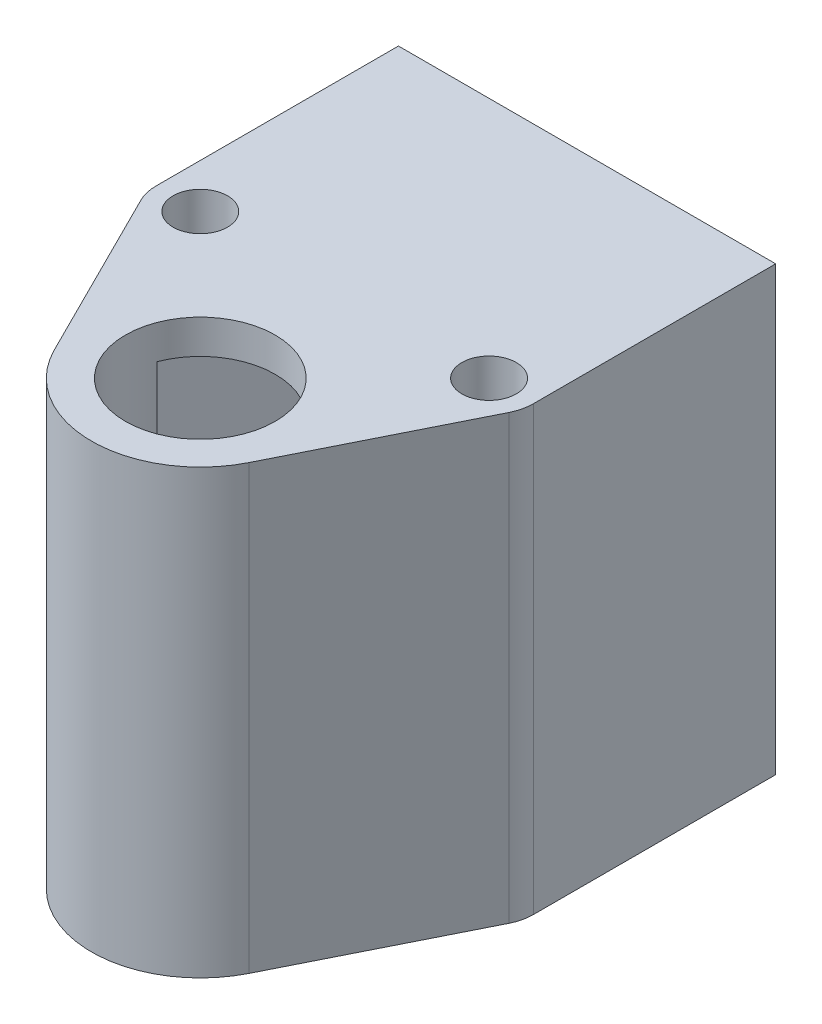
ISO-10303-21;
HEADER;
FILE_DESCRIPTION(('STEP AP214'),'2;1');
FILE_NAME('part.step','',(''),(''),'','','');
FILE_SCHEMA(('AUTOMOTIVE_DESIGN { 1 0 10303 214 1 1 1 1 }'));
ENDSEC;
DATA;
#1=APPLICATION_CONTEXT('core data for automotive mechanical design processes');
#2=APPLICATION_PROTOCOL_DEFINITION('international standard','automotive_design',2000,#1);
#3=PRODUCT_CONTEXT('',#1,'mechanical');
#4=PRODUCT('Part','Part','',(#3));
#5=PRODUCT_RELATED_PRODUCT_CATEGORY('part','',(#4));
#6=PRODUCT_DEFINITION_FORMATION('','',#4);
#7=PRODUCT_DEFINITION_CONTEXT('part definition',#1,'design');
#8=PRODUCT_DEFINITION('design','',#6,#7);
#9=PRODUCT_DEFINITION_SHAPE('','',#8);
#10=(LENGTH_UNIT() NAMED_UNIT(*) SI_UNIT(.MILLI.,.METRE.));
#11=(NAMED_UNIT(*) PLANE_ANGLE_UNIT() SI_UNIT($,.RADIAN.));
#12=(NAMED_UNIT(*) SI_UNIT($,.STERADIAN.) SOLID_ANGLE_UNIT());
#13=UNCERTAINTY_MEASURE_WITH_UNIT(LENGTH_MEASURE(1.E-05),#10,'distance_accuracy_value','');
#14=(GEOMETRIC_REPRESENTATION_CONTEXT(3) GLOBAL_UNCERTAINTY_ASSIGNED_CONTEXT((#13)) GLOBAL_UNIT_ASSIGNED_CONTEXT((#10,
#11,#12)) REPRESENTATION_CONTEXT('',''));
#15=CARTESIAN_POINT('',(0.,0.,0.));
#16=DIRECTION('',(0.,0.,1.));
#17=DIRECTION('',(1.,0.,0.));
#18=AXIS2_PLACEMENT_3D('',#15,#16,#17);
#19=CARTESIAN_POINT('',(0.,55.,0.));
#20=DIRECTION('',(0.,-1.,0.));
#21=DIRECTION('',(0.,0.,-1.));
#22=AXIS2_PLACEMENT_3D('',#19,#20,#21);
#23=CYLINDRICAL_SURFACE('',#22,16.);
#24=DIRECTION('',(0.,-1.,0.));
#25=VECTOR('',#24,1.);
#26=CARTESIAN_POINT('',(-14.3141441755366,55.,7.14879545951293));
#27=LINE('',#26,#25);
#28=CARTESIAN_POINT('',(-14.3141441755366,60.,7.14879545951293));
#29=VERTEX_POINT('',#28);
#30=CARTESIAN_POINT('',(-14.3141441755366,-5.,7.14879545951293));
#31=VERTEX_POINT('',#30);
#32=EDGE_CURVE('E228',#29,#31,#27,.T.);
#33=ORIENTED_EDGE('',*,*,#32,.T.);
#34=CARTESIAN_POINT('',(0.,-5.,0.));
#35=DIRECTION('',(0.,-1.,0.));
#36=DIRECTION('',(0.,0.,-1.));
#37=AXIS2_PLACEMENT_3D('',#34,#35,#36);
#38=CIRCLE('',#37,16.);
#39=CARTESIAN_POINT('',(14.3141441755366,-5.,7.14879545951293));
#40=VERTEX_POINT('',#39);
#41=EDGE_CURVE('E175',#40,#31,#38,.T.);
#42=ORIENTED_EDGE('',*,*,#41,.F.);
#43=DIRECTION('',(0.,-1.,0.));
#44=VECTOR('',#43,1.);
#45=CARTESIAN_POINT('',(14.3141441755366,55.,7.14879545951293));
#46=LINE('',#45,#44);
#47=CARTESIAN_POINT('',(14.3141441755366,60.,7.14879545951293));
#48=VERTEX_POINT('',#47);
#49=EDGE_CURVE('E11',#48,#40,#46,.T.);
#50=ORIENTED_EDGE('',*,*,#49,.F.);
#51=CARTESIAN_POINT('',(0.,60.,0.));
#52=DIRECTION('',(0.,1.,0.));
#53=DIRECTION('',(0.,0.,1.));
#54=AXIS2_PLACEMENT_3D('',#51,#52,#53);
#55=CIRCLE('',#54,16.);
#56=EDGE_CURVE('E195',#29,#48,#55,.T.);
#57=ORIENTED_EDGE('',*,*,#56,.F.);
#58=EDGE_LOOP('',(#33,#42,#50,#57));
#59=FACE_BOUND('',#58,.T.);
#60=ADVANCED_FACE('F33',(#59),#23,.T.);
#61=CARTESIAN_POINT('',(14.3141441755366,55.,7.14879545951293));
#62=DIRECTION('',(-0.894634010971035,0.,-0.446799716219558));
#63=DIRECTION('',(-0.446799716219558,0.,0.894634010971035));
#64=AXIS2_PLACEMENT_3D('',#61,#62,#63);
#65=PLANE('',#64);
#66=ORIENTED_EDGE('',*,*,#49,.T.);
#67=DIRECTION('',(-0.446799716219558,0.,0.894634010971035));
#68=VECTOR('',#67,1.);
#69=CARTESIAN_POINT('',(14.3141441755366,-5.,7.14879545951293));
#70=LINE('',#69,#68);
#71=CARTESIAN_POINT('',(27.0283245069082,-5.,-18.3090052801693));
#72=VERTEX_POINT('',#71);
#73=EDGE_CURVE('E172',#72,#40,#70,.T.);
#74=ORIENTED_EDGE('',*,*,#73,.F.);
#75=DIRECTION('',(0.,-1.,0.));
#76=VECTOR('',#75,1.);
#77=CARTESIAN_POINT('',(27.0283245069082,55.,-18.3090052801693));
#78=LINE('',#77,#76);
#79=CARTESIAN_POINT('',(27.0283245069082,60.,-18.3090052801693));
#80=VERTEX_POINT('',#79);
#81=EDGE_CURVE('E41',#80,#72,#78,.T.);
#82=ORIENTED_EDGE('',*,*,#81,.F.);
#83=DIRECTION('',(0.446799716219558,0.,-0.894634010971035));
#84=VECTOR('',#83,1.);
#85=CARTESIAN_POINT('',(27.0283245069082,60.,-18.3090052801693));
#86=LINE('',#85,#84);
#87=EDGE_CURVE('E198',#48,#80,#86,.T.);
#88=ORIENTED_EDGE('',*,*,#87,.F.);
#89=EDGE_LOOP('',(#66,#74,#82,#88));
#90=FACE_BOUND('',#89,.T.);
#91=ADVANCED_FACE('F269',(#90),#65,.F.);
#92=CARTESIAN_POINT('',(21.2132034355965,55.,-21.2132034355964));
#93=DIRECTION('',(0.,-1.,0.));
#94=DIRECTION('',(0.,0.,-1.));
#95=AXIS2_PLACEMENT_3D('',#92,#93,#94);
#96=CYLINDRICAL_SURFACE('',#95,6.49999999999998);
#97=ORIENTED_EDGE('',*,*,#81,.T.);
#98=CARTESIAN_POINT('',(21.2132034355965,-5.,-21.2132034355964));
#99=DIRECTION('',(0.,-1.,0.));
#100=DIRECTION('',(0.,0.,-1.));
#101=AXIS2_PLACEMENT_3D('',#98,#99,#100);
#102=CIRCLE('',#101,6.49999999999997);
#103=CARTESIAN_POINT('',(27.7132034355965,-5.,-21.2132034355964));
#104=VERTEX_POINT('',#103);
#105=EDGE_CURVE('E169',#104,#72,#102,.T.);
#106=ORIENTED_EDGE('',*,*,#105,.F.);
#107=DIRECTION('',(0.,-1.,0.));
#108=VECTOR('',#107,1.);
#109=CARTESIAN_POINT('',(27.7132034355965,55.,-21.2132034355964));
#110=LINE('',#109,#108);
#111=CARTESIAN_POINT('',(27.7132034355965,60.,-21.2132034355964));
#112=VERTEX_POINT('',#111);
#113=EDGE_CURVE('E259',#112,#104,#110,.T.);
#114=ORIENTED_EDGE('',*,*,#113,.F.);
#115=CARTESIAN_POINT('',(21.2132034355965,60.,-21.2132034355964));
#116=DIRECTION('',(0.,1.,0.));
#117=DIRECTION('',(0.,0.,1.));
#118=AXIS2_PLACEMENT_3D('',#115,#116,#117);
#119=CIRCLE('',#118,6.49999999999997);
#120=EDGE_CURVE('E201',#80,#112,#119,.T.);
#121=ORIENTED_EDGE('',*,*,#120,.F.);
#122=EDGE_LOOP('',(#97,#106,#114,#121));
#123=FACE_BOUND('',#122,.T.);
#124=ADVANCED_FACE('F263',(#123),#96,.T.);
#125=CARTESIAN_POINT('',(27.7132034355965,55.,-56.8231743162401));
#126=DIRECTION('',(-1.,0.,0.));
#127=DIRECTION('',(0.,0.,1.));
#128=AXIS2_PLACEMENT_3D('',#125,#126,#127);
#129=PLANE('',#128);
#130=ORIENTED_EDGE('',*,*,#113,.T.);
#131=DIRECTION('',(0.,0.,1.));
#132=VECTOR('',#131,1.);
#133=CARTESIAN_POINT('',(27.7132034355965,-5.,-21.2132034355964));
#134=LINE('',#133,#132);
#135=CARTESIAN_POINT('',(27.7132034355965,-5.,-56.8231743162401));
#136=VERTEX_POINT('',#135);
#137=EDGE_CURVE('E166',#136,#104,#134,.T.);
#138=ORIENTED_EDGE('',*,*,#137,.F.);
#139=DIRECTION('',(0.,-1.,0.));
#140=VECTOR('',#139,1.);
#141=CARTESIAN_POINT('',(27.7132034355965,55.,-56.8231743162401));
#142=LINE('',#141,#140);
#143=CARTESIAN_POINT('',(27.7132034355965,60.,-56.8231743162401));
#144=VERTEX_POINT('',#143);
#145=EDGE_CURVE('E257',#144,#136,#142,.T.);
#146=ORIENTED_EDGE('',*,*,#145,.F.);
#147=DIRECTION('',(0.,0.,-1.));
#148=VECTOR('',#147,1.);
#149=CARTESIAN_POINT('',(27.7132034355965,60.,-56.8231743162401));
#150=LINE('',#149,#148);
#151=EDGE_CURVE('E204',#112,#144,#150,.T.);
#152=ORIENTED_EDGE('',*,*,#151,.F.);
#153=EDGE_LOOP('',(#130,#138,#146,#152));
#154=FACE_BOUND('',#153,.T.);
#155=ADVANCED_FACE('F296',(#154),#129,.F.);
#156=CARTESIAN_POINT('',(22.7132034355965,55.,-50.2810946379824));
#157=DIRECTION('',(1.,0.,0.));
#158=DIRECTION('',(0.,0.,-1.));
#159=AXIS2_PLACEMENT_3D('',#156,#157,#158);
#160=PLANE('',#159);
#161=DIRECTION('',(0.,0.,1.));
#162=VECTOR('',#161,1.);
#163=CARTESIAN_POINT('',(22.7132034355965,0.,-50.2810946379824));
#164=LINE('',#163,#162);
#165=CARTESIAN_POINT('',(22.7132034355965,0.,-56.8231743162401));
#166=VERTEX_POINT('',#165);
#167=CARTESIAN_POINT('',(22.7132034355965,0.,-50.2810946379824));
#168=VERTEX_POINT('',#167);
#169=EDGE_CURVE('E212',#166,#168,#164,.T.);
#170=ORIENTED_EDGE('',*,*,#169,.T.);
#171=DIRECTION('',(0.,-1.,0.));
#172=VECTOR('',#171,1.);
#173=CARTESIAN_POINT('',(22.7132034355965,55.,-50.2810946379824));
#174=LINE('',#173,#172);
#175=CARTESIAN_POINT('',(22.7132034355965,55.,-50.2810946379824));
#176=VERTEX_POINT('',#175);
#177=EDGE_CURVE('E251',#176,#168,#174,.T.);
#178=ORIENTED_EDGE('',*,*,#177,.F.);
#179=DIRECTION('',(0.,0.,1.));
#180=VECTOR('',#179,1.);
#181=CARTESIAN_POINT('',(22.7132034355965,55.,-50.2810946379824));
#182=LINE('',#181,#180);
#183=CARTESIAN_POINT('',(22.7132034355965,55.,-56.8231743162401));
#184=VERTEX_POINT('',#183);
#185=EDGE_CURVE('E215',#184,#176,#182,.T.);
#186=ORIENTED_EDGE('',*,*,#185,.F.);
#187=DIRECTION('',(0.,-1.,0.));
#188=VECTOR('',#187,1.);
#189=CARTESIAN_POINT('',(22.7132034355965,55.,-56.8231743162401));
#190=LINE('',#189,#188);
#191=EDGE_CURVE('E254',#184,#166,#190,.T.);
#192=ORIENTED_EDGE('',*,*,#191,.T.);
#193=EDGE_LOOP('',(#170,#178,#186,#192));
#194=FACE_BOUND('',#193,.T.);
#195=ADVANCED_FACE('F301',(#194),#160,.F.);
#196=CARTESIAN_POINT('',(10.2854265832779,55.,-3.9));
#197=DIRECTION('',(0.96592582628907,0.,0.258819045102514));
#198=DIRECTION('',(0.258819045102514,0.,-0.96592582628907));
#199=AXIS2_PLACEMENT_3D('',#196,#197,#198);
#200=PLANE('',#199);
#201=DIRECTION('',(-0.258819045102514,0.,0.96592582628907));
#202=VECTOR('',#201,1.);
#203=CARTESIAN_POINT('',(10.2854265832779,0.,-3.9));
#204=LINE('',#203,#202);
#205=CARTESIAN_POINT('',(10.2854265832779,0.,-3.9));
#206=VERTEX_POINT('',#205);
#207=EDGE_CURVE('E231',#168,#206,#204,.T.);
#208=ORIENTED_EDGE('',*,*,#207,.T.);
#209=DIRECTION('',(0.,-1.,0.));
#210=VECTOR('',#209,1.);
#211=CARTESIAN_POINT('',(10.2854265832779,55.,-3.9));
#212=LINE('',#211,#210);
#213=CARTESIAN_POINT('',(10.2854265832779,55.,-3.9));
#214=VERTEX_POINT('',#213);
#215=EDGE_CURVE('E248',#214,#206,#212,.T.);
#216=ORIENTED_EDGE('',*,*,#215,.F.);
#217=DIRECTION('',(-0.258819045102514,0.,0.96592582628907));
#218=VECTOR('',#217,1.);
#219=CARTESIAN_POINT('',(10.2854265832779,55.,-3.9));
#220=LINE('',#219,#218);
#221=EDGE_CURVE('E218',#176,#214,#220,.T.);
#222=ORIENTED_EDGE('',*,*,#221,.F.);
#223=ORIENTED_EDGE('',*,*,#177,.T.);
#224=EDGE_LOOP('',(#208,#216,#222,#223));
#225=FACE_BOUND('',#224,.T.);
#226=ADVANCED_FACE('F305',(#225),#200,.F.);
#227=CARTESIAN_POINT('',(0.,55.,0.));
#228=DIRECTION('',(0.,-1.,0.));
#229=DIRECTION('',(0.,0.,-1.));
#230=AXIS2_PLACEMENT_3D('',#227,#228,#229);
#231=CYLINDRICAL_SURFACE('',#230,11.);
#232=ORIENTED_EDGE('',*,*,#215,.T.);
#233=CARTESIAN_POINT('',(0.,0.,0.));
#234=DIRECTION('',(0.,-1.,0.));
#235=DIRECTION('',(0.,0.,-1.));
#236=AXIS2_PLACEMENT_3D('',#233,#234,#235);
#237=CIRCLE('',#236,11.);
#238=CARTESIAN_POINT('',(-10.2854265832779,0.,-3.90000000000002));
#239=VERTEX_POINT('',#238);
#240=EDGE_CURVE('E162',#239,#206,#237,.T.);
#241=ORIENTED_EDGE('',*,*,#240,.F.);
#242=DIRECTION('',(0.,-1.,0.));
#243=VECTOR('',#242,1.);
#244=CARTESIAN_POINT('',(-10.2854265832779,55.,-3.9));
#245=LINE('',#244,#243);
#246=CARTESIAN_POINT('',(-10.2854265832779,55.,-3.9));
#247=VERTEX_POINT('',#246);
#248=EDGE_CURVE('E245',#247,#239,#245,.T.);
#249=ORIENTED_EDGE('',*,*,#248,.F.);
#250=CARTESIAN_POINT('',(0.,55.,0.));
#251=DIRECTION('',(0.,1.,0.));
#252=DIRECTION('',(0.,0.,1.));
#253=AXIS2_PLACEMENT_3D('',#250,#251,#252);
#254=CIRCLE('',#253,11.);
#255=EDGE_CURVE('E177',#214,#247,#254,.T.);
#256=ORIENTED_EDGE('',*,*,#255,.F.);
#257=EDGE_LOOP('',(#232,#241,#249,#256));
#258=FACE_BOUND('',#257,.T.);
#259=CARTESIAN_POINT('',(0.,60.,0.));
#260=DIRECTION('',(0.,1.,0.));
#261=DIRECTION('',(0.,0.,1.));
#262=AXIS2_PLACEMENT_3D('',#259,#260,#261);
#263=CIRCLE('',#262,11.);
#264=CARTESIAN_POINT('',(0.,60.,11.));
#265=VERTEX_POINT('',#264);
#266=EDGE_CURVE('E179',#265,#265,#263,.T.);
#267=ORIENTED_EDGE('',*,*,#266,.T.);
#268=EDGE_LOOP('',(#267));
#269=FACE_BOUND('',#268,.T.);
#270=CARTESIAN_POINT('',(0.,-5.,0.));
#271=DIRECTION('',(0.,-1.,0.));
#272=DIRECTION('',(0.,0.,-1.));
#273=AXIS2_PLACEMENT_3D('',#270,#271,#272);
#274=CIRCLE('',#273,11.);
#275=CARTESIAN_POINT('',(0.,-5.,-11.));
#276=VERTEX_POINT('',#275);
#277=EDGE_CURVE('E159',#276,#276,#274,.T.);
#278=ORIENTED_EDGE('',*,*,#277,.T.);
#279=EDGE_LOOP('',(#278));
#280=FACE_BOUND('',#279,.T.);
#281=ADVANCED_FACE('F309',(#258,#269,#280),#231,.F.);
#282=CARTESIAN_POINT('',(-10.2854265832779,55.,-3.9));
#283=DIRECTION('',(-0.96592582628907,0.,0.258819045102515));
#284=DIRECTION('',(0.258819045102515,0.,0.96592582628907));
#285=AXIS2_PLACEMENT_3D('',#282,#283,#284);
#286=PLANE('',#285);
#287=DIRECTION('',(-0.258819045102515,0.,-0.96592582628907));
#288=VECTOR('',#287,1.);
#289=CARTESIAN_POINT('',(-10.2854265832779,0.,-3.9));
#290=LINE('',#289,#288);
#291=CARTESIAN_POINT('',(-22.7132034355965,0.,-50.2810946379824));
#292=VERTEX_POINT('',#291);
#293=EDGE_CURVE('E234',#239,#292,#290,.T.);
#294=ORIENTED_EDGE('',*,*,#293,.T.);
#295=DIRECTION('',(0.,-1.,0.));
#296=VECTOR('',#295,1.);
#297=CARTESIAN_POINT('',(-22.7132034355965,55.,-50.2810946379824));
#298=LINE('',#297,#296);
#299=CARTESIAN_POINT('',(-22.7132034355965,55.,-50.2810946379824));
#300=VERTEX_POINT('',#299);
#301=EDGE_CURVE('E48',#300,#292,#298,.T.);
#302=ORIENTED_EDGE('',*,*,#301,.F.);
#303=DIRECTION('',(-0.258819045102515,0.,-0.96592582628907));
#304=VECTOR('',#303,1.);
#305=CARTESIAN_POINT('',(-10.2854265832779,55.,-3.9));
#306=LINE('',#305,#304);
#307=EDGE_CURVE('E222',#247,#300,#306,.T.);
#308=ORIENTED_EDGE('',*,*,#307,.F.);
#309=ORIENTED_EDGE('',*,*,#248,.T.);
#310=EDGE_LOOP('',(#294,#302,#308,#309));
#311=FACE_BOUND('',#310,.T.);
#312=ADVANCED_FACE('F313',(#311),#286,.F.);
#313=CARTESIAN_POINT('',(-22.7132034355965,55.,-50.2810946379824));
#314=DIRECTION('',(-1.,0.,0.));
#315=DIRECTION('',(0.,0.,1.));
#316=AXIS2_PLACEMENT_3D('',#313,#314,#315);
#317=PLANE('',#316);
#318=DIRECTION('',(0.,0.,-1.));
#319=VECTOR('',#318,1.);
#320=CARTESIAN_POINT('',(-22.7132034355965,0.,-50.2810946379824));
#321=LINE('',#320,#319);
#322=CARTESIAN_POINT('',(-22.7132034355965,0.,-56.8231743162401));
#323=VERTEX_POINT('',#322);
#324=EDGE_CURVE('E219',#292,#323,#321,.T.);
#325=ORIENTED_EDGE('',*,*,#324,.T.);
#326=DIRECTION('',(0.,-1.,0.));
#327=VECTOR('',#326,1.);
#328=CARTESIAN_POINT('',(-22.7132034355965,55.,-56.8231743162401));
#329=LINE('',#328,#327);
#330=CARTESIAN_POINT('',(-22.7132034355965,55.,-56.8231743162401));
#331=VERTEX_POINT('',#330);
#332=EDGE_CURVE('E241',#331,#323,#329,.T.);
#333=ORIENTED_EDGE('',*,*,#332,.F.);
#334=DIRECTION('',(0.,0.,-1.));
#335=VECTOR('',#334,1.);
#336=CARTESIAN_POINT('',(-22.7132034355965,55.,-50.2810946379824));
#337=LINE('',#336,#335);
#338=EDGE_CURVE('E225',#300,#331,#337,.T.);
#339=ORIENTED_EDGE('',*,*,#338,.F.);
#340=ORIENTED_EDGE('',*,*,#301,.T.);
#341=EDGE_LOOP('',(#325,#333,#339,#340));
#342=FACE_BOUND('',#341,.T.);
#343=ADVANCED_FACE('F317',(#342),#317,.F.);
#344=CARTESIAN_POINT('',(-27.7132034355965,55.,-56.8231743162401));
#345=DIRECTION('',(0.,0.,1.));
#346=DIRECTION('',(1.,0.,0.));
#347=AXIS2_PLACEMENT_3D('',#344,#345,#346);
#348=PLANE('',#347);
#349=DIRECTION('',(1.,0.,0.));
#350=VECTOR('',#349,1.);
#351=CARTESIAN_POINT('',(27.7132034355965,-5.,-56.8231743162401));
#352=LINE('',#351,#350);
#353=CARTESIAN_POINT('',(-27.7132034355965,-5.,-56.8231743162401));
#354=VERTEX_POINT('',#353);
#355=EDGE_CURVE('E148',#354,#136,#352,.T.);
#356=ORIENTED_EDGE('',*,*,#355,.F.);
#357=DIRECTION('',(0.,-1.,0.));
#358=VECTOR('',#357,1.);
#359=CARTESIAN_POINT('',(-27.7132034355965,55.,-56.8231743162401));
#360=LINE('',#359,#358);
#361=CARTESIAN_POINT('',(-27.7132034355965,60.,-56.8231743162401));
#362=VERTEX_POINT('',#361);
#363=EDGE_CURVE('E139',#362,#354,#360,.T.);
#364=ORIENTED_EDGE('',*,*,#363,.F.);
#365=DIRECTION('',(-1.,0.,0.));
#366=VECTOR('',#365,1.);
#367=CARTESIAN_POINT('',(-27.7132034355965,60.,-56.8231743162401));
#368=LINE('',#367,#366);
#369=EDGE_CURVE('E207',#144,#362,#368,.T.);
#370=ORIENTED_EDGE('',*,*,#369,.F.);
#371=ORIENTED_EDGE('',*,*,#145,.T.);
#372=EDGE_LOOP('',(#356,#364,#370,#371));
#373=FACE_BOUND('',#372,.T.);
#374=ORIENTED_EDGE('',*,*,#332,.T.);
#375=DIRECTION('',(1.,0.,0.));
#376=VECTOR('',#375,1.);
#377=CARTESIAN_POINT('',(27.7132034355965,0.,-56.8231743162401));
#378=LINE('',#377,#376);
#379=EDGE_CURVE('E156',#323,#166,#378,.T.);
#380=ORIENTED_EDGE('',*,*,#379,.T.);
#381=ORIENTED_EDGE('',*,*,#191,.F.);
#382=DIRECTION('',(-1.,0.,0.));
#383=VECTOR('',#382,1.);
#384=CARTESIAN_POINT('',(-27.7132034355965,55.,-56.8231743162401));
#385=LINE('',#384,#383);
#386=EDGE_CURVE('E190',#184,#331,#385,.T.);
#387=ORIENTED_EDGE('',*,*,#386,.T.);
#388=EDGE_LOOP('',(#374,#380,#381,#387));
#389=FACE_BOUND('',#388,.T.);
#390=ADVANCED_FACE('F320',(#373,#389),#348,.F.);
#391=CARTESIAN_POINT('',(-27.7132034355965,55.,-56.8231743162401));
#392=DIRECTION('',(1.,0.,0.));
#393=DIRECTION('',(0.,0.,-1.));
#394=AXIS2_PLACEMENT_3D('',#391,#392,#393);
#395=PLANE('',#394);
#396=ORIENTED_EDGE('',*,*,#363,.T.);
#397=DIRECTION('',(0.,0.,-1.));
#398=VECTOR('',#397,1.);
#399=CARTESIAN_POINT('',(-27.7132034355965,-5.,-56.8231743162401));
#400=LINE('',#399,#398);
#401=CARTESIAN_POINT('',(-27.7132034355965,-5.,-21.2132034355964));
#402=VERTEX_POINT('',#401);
#403=EDGE_CURVE('E143',#402,#354,#400,.T.);
#404=ORIENTED_EDGE('',*,*,#403,.F.);
#405=DIRECTION('',(0.,-1.,0.));
#406=VECTOR('',#405,1.);
#407=CARTESIAN_POINT('',(-27.7132034355965,55.,-21.2132034355964));
#408=LINE('',#407,#406);
#409=CARTESIAN_POINT('',(-27.7132034355965,60.,-21.2132034355964));
#410=VERTEX_POINT('',#409);
#411=EDGE_CURVE('E129',#410,#402,#408,.T.);
#412=ORIENTED_EDGE('',*,*,#411,.F.);
#413=DIRECTION('',(0.,0.,1.));
#414=VECTOR('',#413,1.);
#415=CARTESIAN_POINT('',(-27.7132034355965,60.,-21.2132034355964));
#416=LINE('',#415,#414);
#417=EDGE_CURVE('E210',#362,#410,#416,.T.);
#418=ORIENTED_EDGE('',*,*,#417,.F.);
#419=EDGE_LOOP('',(#396,#404,#412,#418));
#420=FACE_BOUND('',#419,.T.);
#421=ADVANCED_FACE('F144',(#420),#395,.F.);
#422=CARTESIAN_POINT('',(-21.2132034355965,55.,-21.2132034355964));
#423=DIRECTION('',(0.,-1.,0.));
#424=DIRECTION('',(0.,0.,-1.));
#425=AXIS2_PLACEMENT_3D('',#422,#423,#424);
#426=CYLINDRICAL_SURFACE('',#425,6.49999999999998);
#427=ORIENTED_EDGE('',*,*,#411,.T.);
#428=CARTESIAN_POINT('',(-21.2132034355965,-5.,-21.2132034355964));
#429=DIRECTION('',(0.,-1.,0.));
#430=DIRECTION('',(0.,0.,-1.));
#431=AXIS2_PLACEMENT_3D('',#428,#429,#430);
#432=CIRCLE('',#431,6.49999999999998);
#433=CARTESIAN_POINT('',(-27.0283245069082,-5.,-18.3090052801693));
#434=VERTEX_POINT('',#433);
#435=EDGE_CURVE('E133',#434,#402,#432,.T.);
#436=ORIENTED_EDGE('',*,*,#435,.F.);
#437=DIRECTION('',(0.,-1.,0.));
#438=VECTOR('',#437,1.);
#439=CARTESIAN_POINT('',(-27.0283245069082,55.,-18.3090052801693));
#440=LINE('',#439,#438);
#441=CARTESIAN_POINT('',(-27.0283245069082,60.,-18.3090052801692));
#442=VERTEX_POINT('',#441);
#443=EDGE_CURVE('E140',#442,#434,#440,.T.);
#444=ORIENTED_EDGE('',*,*,#443,.F.);
#445=CARTESIAN_POINT('',(-21.2132034355965,60.,-21.2132034355964));
#446=DIRECTION('',(0.,1.,0.));
#447=DIRECTION('',(0.,0.,1.));
#448=AXIS2_PLACEMENT_3D('',#445,#446,#447);
#449=CIRCLE('',#448,6.49999999999998);
#450=EDGE_CURVE('E135',#410,#442,#449,.T.);
#451=ORIENTED_EDGE('',*,*,#450,.F.);
#452=EDGE_LOOP('',(#427,#436,#444,#451));
#453=FACE_BOUND('',#452,.T.);
#454=ADVANCED_FACE('F131',(#453),#426,.T.);
#455=CARTESIAN_POINT('',(-14.3141441755366,55.,7.14879545951293));
#456=DIRECTION('',(0.894634010971035,0.,-0.446799716219558));
#457=DIRECTION('',(-0.446799716219558,0.,-0.894634010971035));
#458=AXIS2_PLACEMENT_3D('',#455,#456,#457);
#459=PLANE('',#458);
#460=ORIENTED_EDGE('',*,*,#443,.T.);
#461=DIRECTION('',(-0.446799716219558,0.,-0.894634010971035));
#462=VECTOR('',#461,1.);
#463=CARTESIAN_POINT('',(-27.0283245069082,-5.,-18.3090052801693));
#464=LINE('',#463,#462);
#465=EDGE_CURVE('E155',#31,#434,#464,.T.);
#466=ORIENTED_EDGE('',*,*,#465,.F.);
#467=ORIENTED_EDGE('',*,*,#32,.F.);
#468=DIRECTION('',(0.446799716219558,0.,0.894634010971035));
#469=VECTOR('',#468,1.);
#470=CARTESIAN_POINT('',(-14.3141441755366,60.,7.14879545951293));
#471=LINE('',#470,#469);
#472=EDGE_CURVE('E192',#442,#29,#471,.T.);
#473=ORIENTED_EDGE('',*,*,#472,.F.);
#474=EDGE_LOOP('',(#460,#466,#467,#473));
#475=FACE_BOUND('',#474,.T.);
#476=ADVANCED_FACE('F277',(#475),#459,.F.);
#477=CARTESIAN_POINT('',(-21.2132034355965,55.,-21.2132034355964));
#478=DIRECTION('',(0.,-1.,0.));
#479=DIRECTION('',(0.,0.,-1.));
#480=AXIS2_PLACEMENT_3D('',#477,#478,#479);
#481=CYLINDRICAL_SURFACE('',#480,4.00000000000021);
#482=CARTESIAN_POINT('',(-21.2132034355965,60.,-21.2132034355964));
#483=DIRECTION('',(0.,1.,0.));
#484=DIRECTION('',(0.,0.,1.));
#485=AXIS2_PLACEMENT_3D('',#482,#483,#484);
#486=CIRCLE('',#485,4.00000000000021);
#487=CARTESIAN_POINT('',(-21.2132034355965,60.,-17.2132034355961));
#488=VERTEX_POINT('',#487);
#489=EDGE_CURVE('E187',#488,#488,#486,.T.);
#490=ORIENTED_EDGE('',*,*,#489,.T.);
#491=EDGE_LOOP('',(#490));
#492=FACE_BOUND('',#491,.T.);
#493=CARTESIAN_POINT('',(-21.2132034355965,-5.,-21.2132034355964));
#494=DIRECTION('',(0.,-1.,0.));
#495=DIRECTION('',(0.,0.,-1.));
#496=AXIS2_PLACEMENT_3D('',#493,#494,#495);
#497=CIRCLE('',#496,4.00000000000021);
#498=CARTESIAN_POINT('',(-21.2132034355965,-5.,-25.2132034355966));
#499=VERTEX_POINT('',#498);
#500=EDGE_CURVE('E400',#499,#499,#497,.T.);
#501=ORIENTED_EDGE('',*,*,#500,.T.);
#502=EDGE_LOOP('',(#501));
#503=FACE_BOUND('',#502,.T.);
#504=ADVANCED_FACE('F279',(#492,#503),#481,.F.);
#505=CARTESIAN_POINT('',(21.2132034355965,55.,-21.2132034355964));
#506=DIRECTION('',(0.,-1.,0.));
#507=DIRECTION('',(0.,0.,-1.));
#508=AXIS2_PLACEMENT_3D('',#505,#506,#507);
#509=CYLINDRICAL_SURFACE('',#508,4.00000000000021);
#510=CARTESIAN_POINT('',(21.2132034355965,60.,-21.2132034355964));
#511=DIRECTION('',(0.,1.,0.));
#512=DIRECTION('',(0.,0.,1.));
#513=AXIS2_PLACEMENT_3D('',#510,#511,#512);
#514=CIRCLE('',#513,4.00000000000021);
#515=CARTESIAN_POINT('',(21.2132034355965,60.,-17.2132034355962));
#516=VERTEX_POINT('',#515);
#517=EDGE_CURVE('E182',#516,#516,#514,.T.);
#518=ORIENTED_EDGE('',*,*,#517,.T.);
#519=EDGE_LOOP('',(#518));
#520=FACE_BOUND('',#519,.T.);
#521=CARTESIAN_POINT('',(21.2132034355965,-5.,-21.2132034355964));
#522=DIRECTION('',(0.,-1.,0.));
#523=DIRECTION('',(0.,0.,-1.));
#524=AXIS2_PLACEMENT_3D('',#521,#522,#523);
#525=CIRCLE('',#524,4.00000000000021);
#526=CARTESIAN_POINT('',(21.2132034355965,-5.,-25.2132034355966));
#527=VERTEX_POINT('',#526);
#528=EDGE_CURVE('E397',#527,#527,#525,.T.);
#529=ORIENTED_EDGE('',*,*,#528,.T.);
#530=EDGE_LOOP('',(#529));
#531=FACE_BOUND('',#530,.T.);
#532=ADVANCED_FACE('F285',(#520,#531),#509,.F.);
#533=CARTESIAN_POINT('',(-21.2132034355965,55.,-21.2132034355964));
#534=DIRECTION('',(0.,1.,0.));
#535=DIRECTION('',(0.,0.,1.));
#536=AXIS2_PLACEMENT_3D('',#533,#534,#535);
#537=PLANE('',#536);
#538=ORIENTED_EDGE('',*,*,#386,.F.);
#539=ORIENTED_EDGE('',*,*,#185,.T.);
#540=ORIENTED_EDGE('',*,*,#221,.T.);
#541=ORIENTED_EDGE('',*,*,#255,.T.);
#542=ORIENTED_EDGE('',*,*,#307,.T.);
#543=ORIENTED_EDGE('',*,*,#338,.T.);
#544=EDGE_LOOP('',(#538,#539,#540,#541,#542,#543));
#545=FACE_BOUND('',#544,.T.);
#546=ADVANCED_FACE('F356',(#545),#537,.F.);
#547=CARTESIAN_POINT('',(-21.2132034355965,60.,-21.2132034355964));
#548=DIRECTION('',(0.,1.,0.));
#549=DIRECTION('',(0.,0.,1.));
#550=AXIS2_PLACEMENT_3D('',#547,#548,#549);
#551=PLANE('',#550);
#552=ORIENTED_EDGE('',*,*,#517,.F.);
#553=EDGE_LOOP('',(#552));
#554=FACE_BOUND('',#553,.T.);
#555=ORIENTED_EDGE('',*,*,#450,.T.);
#556=ORIENTED_EDGE('',*,*,#472,.T.);
#557=ORIENTED_EDGE('',*,*,#56,.T.);
#558=ORIENTED_EDGE('',*,*,#87,.T.);
#559=ORIENTED_EDGE('',*,*,#120,.T.);
#560=ORIENTED_EDGE('',*,*,#151,.T.);
#561=ORIENTED_EDGE('',*,*,#369,.T.);
#562=ORIENTED_EDGE('',*,*,#417,.T.);
#563=EDGE_LOOP('',(#555,#556,#557,#558,#559,#560,#561,#562));
#564=FACE_BOUND('',#563,.T.);
#565=ORIENTED_EDGE('',*,*,#489,.F.);
#566=EDGE_LOOP('',(#565));
#567=FACE_BOUND('',#566,.T.);
#568=ORIENTED_EDGE('',*,*,#266,.F.);
#569=EDGE_LOOP('',(#568));
#570=FACE_BOUND('',#569,.T.);
#571=ADVANCED_FACE('F273',(#554,#564,#567,#570),#551,.T.);
#572=CARTESIAN_POINT('',(-21.2132034355965,-5.,-21.2132034355964));
#573=DIRECTION('',(0.,-1.,0.));
#574=DIRECTION('',(0.,0.,-1.));
#575=AXIS2_PLACEMENT_3D('',#572,#573,#574);
#576=PLANE('',#575);
#577=ORIENTED_EDGE('',*,*,#528,.F.);
#578=EDGE_LOOP('',(#577));
#579=FACE_BOUND('',#578,.T.);
#580=ORIENTED_EDGE('',*,*,#435,.T.);
#581=ORIENTED_EDGE('',*,*,#403,.T.);
#582=ORIENTED_EDGE('',*,*,#355,.T.);
#583=ORIENTED_EDGE('',*,*,#137,.T.);
#584=ORIENTED_EDGE('',*,*,#105,.T.);
#585=ORIENTED_EDGE('',*,*,#73,.T.);
#586=ORIENTED_EDGE('',*,*,#41,.T.);
#587=ORIENTED_EDGE('',*,*,#465,.T.);
#588=EDGE_LOOP('',(#580,#581,#582,#583,#584,#585,#586,#587));
#589=FACE_BOUND('',#588,.T.);
#590=ORIENTED_EDGE('',*,*,#277,.F.);
#591=EDGE_LOOP('',(#590));
#592=FACE_BOUND('',#591,.T.);
#593=ORIENTED_EDGE('',*,*,#500,.F.);
#594=EDGE_LOOP('',(#593));
#595=FACE_BOUND('',#594,.T.);
#596=ADVANCED_FACE('F151',(#579,#589,#592,#595),#576,.T.);
#597=CARTESIAN_POINT('',(-21.2132034355965,0.,-21.2132034355964));
#598=DIRECTION('',(0.,-1.,0.));
#599=DIRECTION('',(0.,0.,-1.));
#600=AXIS2_PLACEMENT_3D('',#597,#598,#599);
#601=PLANE('',#600);
#602=ORIENTED_EDGE('',*,*,#324,.F.);
#603=ORIENTED_EDGE('',*,*,#293,.F.);
#604=ORIENTED_EDGE('',*,*,#240,.T.);
#605=ORIENTED_EDGE('',*,*,#207,.F.);
#606=ORIENTED_EDGE('',*,*,#169,.F.);
#607=ORIENTED_EDGE('',*,*,#379,.F.);
#608=EDGE_LOOP('',(#602,#603,#604,#605,#606,#607));
#609=FACE_BOUND('',#608,.T.);
#610=ADVANCED_FACE('F368',(#609),#601,.F.);
#611=CLOSED_SHELL('',(#60,#91,#124,#155,#195,#226,#281,#312,#343,#390,#421,#454,#476,#504,#532,
#546,#571,#596,#610));
#612=MANIFOLD_SOLID_BREP('B2',#611);
#613=ADVANCED_BREP_SHAPE_REPRESENTATION('',(#18,#612),#14);
#614=SHAPE_DEFINITION_REPRESENTATION(#9,#613);
ENDSEC;
END-ISO-10303-21;
